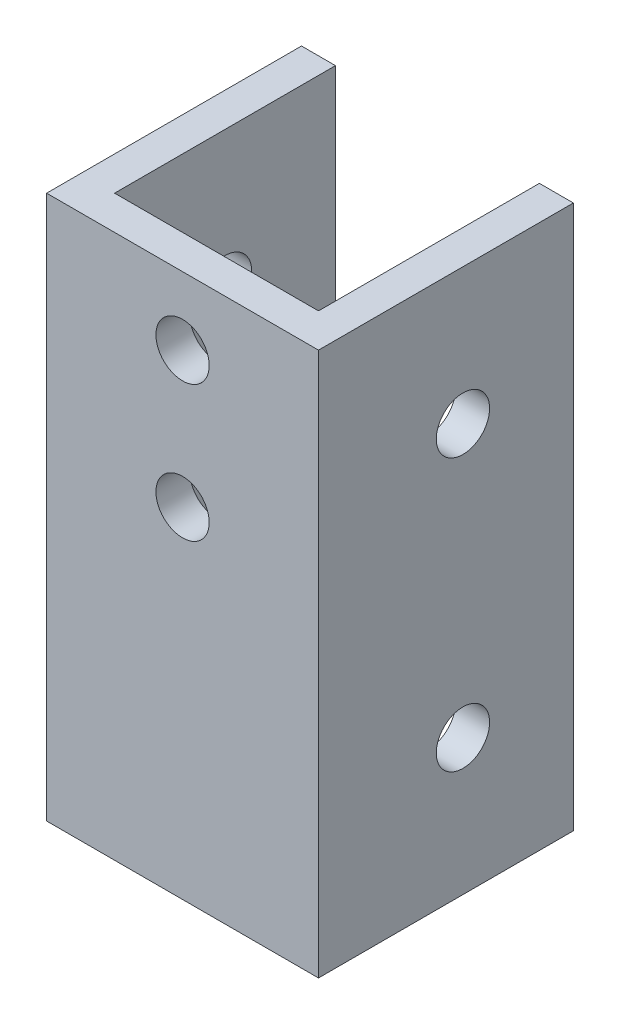
ISO-10303-21;
HEADER;
FILE_DESCRIPTION(('STEP AP214'),'2;1');
FILE_NAME('part.step','',(''),(''),'','','');
FILE_SCHEMA(('AUTOMOTIVE_DESIGN { 1 0 10303 214 1 1 1 1 }'));
ENDSEC;
DATA;
#1=APPLICATION_CONTEXT('core data for automotive mechanical design processes');
#2=APPLICATION_PROTOCOL_DEFINITION('international standard','automotive_design',2000,#1);
#3=PRODUCT_CONTEXT('',#1,'mechanical');
#4=PRODUCT('Part','Part','',(#3));
#5=PRODUCT_RELATED_PRODUCT_CATEGORY('part','',(#4));
#6=PRODUCT_DEFINITION_FORMATION('','',#4);
#7=PRODUCT_DEFINITION_CONTEXT('part definition',#1,'design');
#8=PRODUCT_DEFINITION('design','',#6,#7);
#9=PRODUCT_DEFINITION_SHAPE('','',#8);
#10=(LENGTH_UNIT() NAMED_UNIT(*) SI_UNIT(.MILLI.,.METRE.));
#11=(NAMED_UNIT(*) PLANE_ANGLE_UNIT() SI_UNIT($,.RADIAN.));
#12=(NAMED_UNIT(*) SI_UNIT($,.STERADIAN.) SOLID_ANGLE_UNIT());
#13=UNCERTAINTY_MEASURE_WITH_UNIT(LENGTH_MEASURE(1.E-05),#10,'distance_accuracy_value','');
#14=(GEOMETRIC_REPRESENTATION_CONTEXT(3) GLOBAL_UNCERTAINTY_ASSIGNED_CONTEXT((#13)) GLOBAL_UNIT_ASSIGNED_CONTEXT((#10,
#11,#12)) REPRESENTATION_CONTEXT('',''));
#15=CARTESIAN_POINT('',(0.,0.,0.));
#16=DIRECTION('',(0.,0.,1.));
#17=DIRECTION('',(1.,0.,0.));
#18=AXIS2_PLACEMENT_3D('',#15,#16,#17);
#19=CARTESIAN_POINT('',(0.,50.8,-23.8125));
#20=DIRECTION('',(1.,0.,0.));
#21=DIRECTION('',(0.,0.,-1.));
#22=AXIS2_PLACEMENT_3D('',#19,#20,#21);
#23=PLANE('',#22);
#24=CARTESIAN_POINT('',(0.,12.7,-13.49375));
#25=DIRECTION('',(1.,0.,0.));
#26=DIRECTION('',(0.,0.,-1.));
#27=AXIS2_PLACEMENT_3D('',#24,#25,#26);
#28=CIRCLE('',#27,2.4892);
#29=CARTESIAN_POINT('',(0.,12.7,-15.98295));
#30=VERTEX_POINT('',#29);
#31=EDGE_CURVE('E161',#30,#30,#28,.T.);
#32=ORIENTED_EDGE('',*,*,#31,.T.);
#33=EDGE_LOOP('',(#32));
#34=FACE_BOUND('',#33,.T.);
#35=CARTESIAN_POINT('',(0.,38.1,-13.49375));
#36=DIRECTION('',(1.,0.,0.));
#37=DIRECTION('',(0.,0.,-1.));
#38=AXIS2_PLACEMENT_3D('',#35,#36,#37);
#39=CIRCLE('',#38,2.4892);
#40=CARTESIAN_POINT('',(0.,38.1,-15.98295));
#41=VERTEX_POINT('',#40);
#42=EDGE_CURVE('E182',#41,#41,#39,.T.);
#43=ORIENTED_EDGE('',*,*,#42,.T.);
#44=EDGE_LOOP('',(#43));
#45=FACE_BOUND('',#44,.T.);
#46=DIRECTION('',(0.,0.,1.));
#47=VECTOR('',#46,1.);
#48=CARTESIAN_POINT('',(0.,0.,-23.8125));
#49=LINE('',#48,#47);
#50=CARTESIAN_POINT('',(0.,0.,-23.8125));
#51=VERTEX_POINT('',#50);
#52=CARTESIAN_POINT('',(0.,0.,0.));
#53=VERTEX_POINT('',#52);
#54=EDGE_CURVE('E130',#51,#53,#49,.T.);
#55=ORIENTED_EDGE('',*,*,#54,.T.);
#56=DIRECTION('',(0.,-1.,0.));
#57=VECTOR('',#56,1.);
#58=CARTESIAN_POINT('',(0.,50.8,0.));
#59=LINE('',#58,#57);
#60=CARTESIAN_POINT('',(0.,50.8,0.));
#61=VERTEX_POINT('',#60);
#62=EDGE_CURVE('E11',#61,#53,#59,.T.);
#63=ORIENTED_EDGE('',*,*,#62,.F.);
#64=DIRECTION('',(0.,0.,1.));
#65=VECTOR('',#64,1.);
#66=CARTESIAN_POINT('',(0.,50.8,-23.8125));
#67=LINE('',#66,#65);
#68=CARTESIAN_POINT('',(0.,50.8,-23.8125));
#69=VERTEX_POINT('',#68);
#70=EDGE_CURVE('E145',#69,#61,#67,.T.);
#71=ORIENTED_EDGE('',*,*,#70,.F.);
#72=DIRECTION('',(0.,-1.,0.));
#73=VECTOR('',#72,1.);
#74=CARTESIAN_POINT('',(0.,50.8,-23.8125));
#75=LINE('',#74,#73);
#76=EDGE_CURVE('E126',#69,#51,#75,.T.);
#77=ORIENTED_EDGE('',*,*,#76,.T.);
#78=EDGE_LOOP('',(#55,#63,#71,#77));
#79=FACE_BOUND('',#78,.T.);
#80=ADVANCED_FACE('F32',(#34,#45,#79),#23,.F.);
#81=CARTESIAN_POINT('',(0.,50.8,0.));
#82=DIRECTION('',(0.,0.,-1.));
#83=DIRECTION('',(-1.,0.,0.));
#84=AXIS2_PLACEMENT_3D('',#81,#82,#83);
#85=PLANE('',#84);
#86=CARTESIAN_POINT('',(12.7,44.45,0.));
#87=DIRECTION('',(0.,0.,1.));
#88=DIRECTION('',(1.,0.,0.));
#89=AXIS2_PLACEMENT_3D('',#86,#87,#88);
#90=CIRCLE('',#89,2.4892);
#91=CARTESIAN_POINT('',(15.1892,44.45,0.));
#92=VERTEX_POINT('',#91);
#93=EDGE_CURVE('E166',#92,#92,#90,.T.);
#94=ORIENTED_EDGE('',*,*,#93,.F.);
#95=EDGE_LOOP('',(#94));
#96=FACE_BOUND('',#95,.T.);
#97=CARTESIAN_POINT('',(12.7,31.75,0.));
#98=DIRECTION('',(0.,0.,1.));
#99=DIRECTION('',(1.,0.,0.));
#100=AXIS2_PLACEMENT_3D('',#97,#98,#99);
#101=CIRCLE('',#100,2.4892);
#102=CARTESIAN_POINT('',(15.1892,31.75,0.));
#103=VERTEX_POINT('',#102);
#104=EDGE_CURVE('E172',#103,#103,#101,.T.);
#105=ORIENTED_EDGE('',*,*,#104,.F.);
#106=EDGE_LOOP('',(#105));
#107=FACE_BOUND('',#106,.T.);
#108=DIRECTION('',(1.,0.,0.));
#109=VECTOR('',#108,1.);
#110=CARTESIAN_POINT('',(0.,0.,0.));
#111=LINE('',#110,#109);
#112=CARTESIAN_POINT('',(25.4,0.,0.));
#113=VERTEX_POINT('',#112);
#114=EDGE_CURVE('E133',#53,#113,#111,.T.);
#115=ORIENTED_EDGE('',*,*,#114,.T.);
#116=DIRECTION('',(0.,-1.,0.));
#117=VECTOR('',#116,1.);
#118=CARTESIAN_POINT('',(25.4,50.8,0.));
#119=LINE('',#118,#117);
#120=CARTESIAN_POINT('',(25.4,50.8,0.));
#121=VERTEX_POINT('',#120);
#122=EDGE_CURVE('E41',#121,#113,#119,.T.);
#123=ORIENTED_EDGE('',*,*,#122,.F.);
#124=DIRECTION('',(1.,0.,0.));
#125=VECTOR('',#124,1.);
#126=CARTESIAN_POINT('',(0.,50.8,0.));
#127=LINE('',#126,#125);
#128=EDGE_CURVE('E93',#61,#121,#127,.T.);
#129=ORIENTED_EDGE('',*,*,#128,.F.);
#130=ORIENTED_EDGE('',*,*,#62,.T.);
#131=EDGE_LOOP('',(#115,#123,#129,#130));
#132=FACE_BOUND('',#131,.T.);
#133=ADVANCED_FACE('F227',(#96,#107,#132),#85,.F.);
#134=CARTESIAN_POINT('',(25.4,50.8,0.));
#135=DIRECTION('',(-1.,0.,0.));
#136=DIRECTION('',(0.,0.,1.));
#137=AXIS2_PLACEMENT_3D('',#134,#135,#136);
#138=PLANE('',#137);
#139=CARTESIAN_POINT('',(25.4,12.7,-13.49375));
#140=DIRECTION('',(1.,0.,0.));
#141=DIRECTION('',(0.,0.,-1.));
#142=AXIS2_PLACEMENT_3D('',#139,#140,#141);
#143=CIRCLE('',#142,2.4892);
#144=CARTESIAN_POINT('',(25.4,12.7,-15.98295));
#145=VERTEX_POINT('',#144);
#146=EDGE_CURVE('E179',#145,#145,#143,.T.);
#147=ORIENTED_EDGE('',*,*,#146,.F.);
#148=EDGE_LOOP('',(#147));
#149=FACE_BOUND('',#148,.T.);
#150=CARTESIAN_POINT('',(25.4,38.1,-13.49375));
#151=DIRECTION('',(1.,0.,0.));
#152=DIRECTION('',(0.,0.,-1.));
#153=AXIS2_PLACEMENT_3D('',#150,#151,#152);
#154=CIRCLE('',#153,2.4892);
#155=CARTESIAN_POINT('',(25.4,38.1,-15.98295));
#156=VERTEX_POINT('',#155);
#157=EDGE_CURVE('E170',#156,#156,#154,.T.);
#158=ORIENTED_EDGE('',*,*,#157,.F.);
#159=EDGE_LOOP('',(#158));
#160=FACE_BOUND('',#159,.T.);
#161=DIRECTION('',(0.,0.,-1.));
#162=VECTOR('',#161,1.);
#163=CARTESIAN_POINT('',(25.4,0.,0.));
#164=LINE('',#163,#162);
#165=CARTESIAN_POINT('',(25.4,0.,-23.8125));
#166=VERTEX_POINT('',#165);
#167=EDGE_CURVE('E136',#113,#166,#164,.T.);
#168=ORIENTED_EDGE('',*,*,#167,.T.);
#169=DIRECTION('',(0.,-1.,0.));
#170=VECTOR('',#169,1.);
#171=CARTESIAN_POINT('',(25.4,50.8,-23.8125));
#172=LINE('',#171,#170);
#173=CARTESIAN_POINT('',(25.4,50.8,-23.8125));
#174=VERTEX_POINT('',#173);
#175=EDGE_CURVE('E152',#174,#166,#172,.T.);
#176=ORIENTED_EDGE('',*,*,#175,.F.);
#177=DIRECTION('',(0.,0.,-1.));
#178=VECTOR('',#177,1.);
#179=CARTESIAN_POINT('',(25.4,50.8,0.));
#180=LINE('',#179,#178);
#181=EDGE_CURVE('E195',#121,#174,#180,.T.);
#182=ORIENTED_EDGE('',*,*,#181,.F.);
#183=ORIENTED_EDGE('',*,*,#122,.T.);
#184=EDGE_LOOP('',(#168,#176,#182,#183));
#185=FACE_BOUND('',#184,.T.);
#186=ADVANCED_FACE('F232',(#149,#160,#185),#138,.F.);
#187=CARTESIAN_POINT('',(25.4,50.8,-23.8125));
#188=DIRECTION('',(0.,0.,1.));
#189=DIRECTION('',(1.,0.,0.));
#190=AXIS2_PLACEMENT_3D('',#187,#188,#189);
#191=PLANE('',#190);
#192=DIRECTION('',(-1.,0.,0.));
#193=VECTOR('',#192,1.);
#194=CARTESIAN_POINT('',(25.4,0.,-23.8125));
#195=LINE('',#194,#193);
#196=CARTESIAN_POINT('',(22.225,0.,-23.8125));
#197=VERTEX_POINT('',#196);
#198=EDGE_CURVE('E138',#166,#197,#195,.T.);
#199=ORIENTED_EDGE('',*,*,#198,.T.);
#200=DIRECTION('',(0.,-1.,0.));
#201=VECTOR('',#200,1.);
#202=CARTESIAN_POINT('',(22.225,50.8,-23.8125));
#203=LINE('',#202,#201);
#204=CARTESIAN_POINT('',(22.225,50.8,-23.8125));
#205=VERTEX_POINT('',#204);
#206=EDGE_CURVE('E149',#205,#197,#203,.T.);
#207=ORIENTED_EDGE('',*,*,#206,.F.);
#208=DIRECTION('',(-1.,0.,0.));
#209=VECTOR('',#208,1.);
#210=CARTESIAN_POINT('',(25.4,50.8,-23.8125));
#211=LINE('',#210,#209);
#212=EDGE_CURVE('E197',#174,#205,#211,.T.);
#213=ORIENTED_EDGE('',*,*,#212,.F.);
#214=ORIENTED_EDGE('',*,*,#175,.T.);
#215=EDGE_LOOP('',(#199,#207,#213,#214));
#216=FACE_BOUND('',#215,.T.);
#217=ADVANCED_FACE('F203',(#216),#191,.F.);
#218=CARTESIAN_POINT('',(22.225,50.8,-23.8125));
#219=DIRECTION('',(1.,0.,0.));
#220=DIRECTION('',(0.,0.,-1.));
#221=AXIS2_PLACEMENT_3D('',#218,#219,#220);
#222=PLANE('',#221);
#223=CARTESIAN_POINT('',(22.225,12.7,-13.49375));
#224=DIRECTION('',(1.,0.,0.));
#225=DIRECTION('',(0.,0.,-1.));
#226=AXIS2_PLACEMENT_3D('',#223,#224,#225);
#227=CIRCLE('',#226,2.4892);
#228=CARTESIAN_POINT('',(22.225,12.7,-15.98295));
#229=VERTEX_POINT('',#228);
#230=EDGE_CURVE('E134',#229,#229,#227,.T.);
#231=ORIENTED_EDGE('',*,*,#230,.T.);
#232=EDGE_LOOP('',(#231));
#233=FACE_BOUND('',#232,.T.);
#234=CARTESIAN_POINT('',(22.225,38.1,-13.49375));
#235=DIRECTION('',(1.,0.,0.));
#236=DIRECTION('',(0.,0.,-1.));
#237=AXIS2_PLACEMENT_3D('',#234,#235,#236);
#238=CIRCLE('',#237,2.4892);
#239=CARTESIAN_POINT('',(22.225,38.1,-15.98295));
#240=VERTEX_POINT('',#239);
#241=EDGE_CURVE('E160',#240,#240,#238,.T.);
#242=ORIENTED_EDGE('',*,*,#241,.T.);
#243=EDGE_LOOP('',(#242));
#244=FACE_BOUND('',#243,.T.);
#245=DIRECTION('',(0.,0.,1.));
#246=VECTOR('',#245,1.);
#247=CARTESIAN_POINT('',(22.225,0.,-23.8125));
#248=LINE('',#247,#246);
#249=CARTESIAN_POINT('',(22.225,0.,-3.175));
#250=VERTEX_POINT('',#249);
#251=EDGE_CURVE('E140',#197,#250,#248,.T.);
#252=ORIENTED_EDGE('',*,*,#251,.T.);
#253=DIRECTION('',(0.,-1.,0.));
#254=VECTOR('',#253,1.);
#255=CARTESIAN_POINT('',(22.225,50.8,-3.175));
#256=LINE('',#255,#254);
#257=CARTESIAN_POINT('',(22.225,50.8,-3.175));
#258=VERTEX_POINT('',#257);
#259=EDGE_CURVE('E121',#258,#250,#256,.T.);
#260=ORIENTED_EDGE('',*,*,#259,.F.);
#261=DIRECTION('',(0.,0.,1.));
#262=VECTOR('',#261,1.);
#263=CARTESIAN_POINT('',(22.225,50.8,-23.8125));
#264=LINE('',#263,#262);
#265=EDGE_CURVE('E112',#205,#258,#264,.T.);
#266=ORIENTED_EDGE('',*,*,#265,.F.);
#267=ORIENTED_EDGE('',*,*,#206,.T.);
#268=EDGE_LOOP('',(#252,#260,#266,#267));
#269=FACE_BOUND('',#268,.T.);
#270=ADVANCED_FACE('F207',(#233,#244,#269),#222,.F.);
#271=CARTESIAN_POINT('',(22.225,50.8,-3.175));
#272=DIRECTION('',(0.,0.,1.));
#273=DIRECTION('',(1.,0.,0.));
#274=AXIS2_PLACEMENT_3D('',#271,#272,#273);
#275=PLANE('',#274);
#276=CARTESIAN_POINT('',(12.7,44.45,-3.175));
#277=DIRECTION('',(0.,0.,1.));
#278=DIRECTION('',(1.,0.,0.));
#279=AXIS2_PLACEMENT_3D('',#276,#277,#278);
#280=CIRCLE('',#279,2.4892);
#281=CARTESIAN_POINT('',(15.1892,44.45,-3.175));
#282=VERTEX_POINT('',#281);
#283=EDGE_CURVE('E35',#282,#282,#280,.T.);
#284=ORIENTED_EDGE('',*,*,#283,.T.);
#285=EDGE_LOOP('',(#284));
#286=FACE_BOUND('',#285,.T.);
#287=CARTESIAN_POINT('',(12.7,31.75,-3.175));
#288=DIRECTION('',(0.,0.,1.));
#289=DIRECTION('',(1.,0.,0.));
#290=AXIS2_PLACEMENT_3D('',#287,#288,#289);
#291=CIRCLE('',#290,2.4892);
#292=CARTESIAN_POINT('',(15.1892,31.75,-3.175));
#293=VERTEX_POINT('',#292);
#294=EDGE_CURVE('E164',#293,#293,#291,.T.);
#295=ORIENTED_EDGE('',*,*,#294,.T.);
#296=EDGE_LOOP('',(#295));
#297=FACE_BOUND('',#296,.T.);
#298=DIRECTION('',(-1.,0.,0.));
#299=VECTOR('',#298,1.);
#300=CARTESIAN_POINT('',(22.225,0.,-3.175));
#301=LINE('',#300,#299);
#302=CARTESIAN_POINT('',(3.175,0.,-3.175));
#303=VERTEX_POINT('',#302);
#304=EDGE_CURVE('E120',#250,#303,#301,.T.);
#305=ORIENTED_EDGE('',*,*,#304,.T.);
#306=DIRECTION('',(0.,-1.,0.));
#307=VECTOR('',#306,1.);
#308=CARTESIAN_POINT('',(3.175,50.8,-3.175));
#309=LINE('',#308,#307);
#310=CARTESIAN_POINT('',(3.175,50.8,-3.175));
#311=VERTEX_POINT('',#310);
#312=EDGE_CURVE('E117',#311,#303,#309,.T.);
#313=ORIENTED_EDGE('',*,*,#312,.F.);
#314=DIRECTION('',(-1.,0.,0.));
#315=VECTOR('',#314,1.);
#316=CARTESIAN_POINT('',(22.225,50.8,-3.175));
#317=LINE('',#316,#315);
#318=EDGE_CURVE('E106',#258,#311,#317,.T.);
#319=ORIENTED_EDGE('',*,*,#318,.F.);
#320=ORIENTED_EDGE('',*,*,#259,.T.);
#321=EDGE_LOOP('',(#305,#313,#319,#320));
#322=FACE_BOUND('',#321,.T.);
#323=ADVANCED_FACE('F118',(#286,#297,#322),#275,.F.);
#324=CARTESIAN_POINT('',(3.175,50.8,-3.175));
#325=DIRECTION('',(-1.,0.,0.));
#326=DIRECTION('',(0.,0.,1.));
#327=AXIS2_PLACEMENT_3D('',#324,#325,#326);
#328=PLANE('',#327);
#329=CARTESIAN_POINT('',(3.175,12.7,-13.49375));
#330=DIRECTION('',(-1.,0.,0.));
#331=DIRECTION('',(0.,0.,1.));
#332=AXIS2_PLACEMENT_3D('',#329,#330,#331);
#333=CIRCLE('',#332,2.4892);
#334=CARTESIAN_POINT('',(3.175,12.7,-11.00455));
#335=VERTEX_POINT('',#334);
#336=EDGE_CURVE('E162',#335,#335,#333,.T.);
#337=ORIENTED_EDGE('',*,*,#336,.T.);
#338=EDGE_LOOP('',(#337));
#339=FACE_BOUND('',#338,.T.);
#340=CARTESIAN_POINT('',(3.175,38.1,-13.49375));
#341=DIRECTION('',(-1.,0.,0.));
#342=DIRECTION('',(0.,0.,1.));
#343=AXIS2_PLACEMENT_3D('',#340,#341,#342);
#344=CIRCLE('',#343,2.4892);
#345=CARTESIAN_POINT('',(3.175,38.1,-11.00455));
#346=VERTEX_POINT('',#345);
#347=EDGE_CURVE('E157',#346,#346,#344,.T.);
#348=ORIENTED_EDGE('',*,*,#347,.T.);
#349=EDGE_LOOP('',(#348));
#350=FACE_BOUND('',#349,.T.);
#351=DIRECTION('',(0.,0.,-1.));
#352=VECTOR('',#351,1.);
#353=CARTESIAN_POINT('',(3.175,0.,-3.175));
#354=LINE('',#353,#352);
#355=CARTESIAN_POINT('',(3.175,0.,-23.8125));
#356=VERTEX_POINT('',#355);
#357=EDGE_CURVE('E79',#303,#356,#354,.T.);
#358=ORIENTED_EDGE('',*,*,#357,.T.);
#359=DIRECTION('',(0.,-1.,0.));
#360=VECTOR('',#359,1.);
#361=CARTESIAN_POINT('',(3.175,50.8,-23.8125));
#362=LINE('',#361,#360);
#363=CARTESIAN_POINT('',(3.175,50.8,-23.8125));
#364=VERTEX_POINT('',#363);
#365=EDGE_CURVE('E122',#364,#356,#362,.T.);
#366=ORIENTED_EDGE('',*,*,#365,.F.);
#367=DIRECTION('',(0.,0.,-1.));
#368=VECTOR('',#367,1.);
#369=CARTESIAN_POINT('',(3.175,50.8,-3.175));
#370=LINE('',#369,#368);
#371=EDGE_CURVE('E110',#311,#364,#370,.T.);
#372=ORIENTED_EDGE('',*,*,#371,.F.);
#373=ORIENTED_EDGE('',*,*,#312,.T.);
#374=EDGE_LOOP('',(#358,#366,#372,#373));
#375=FACE_BOUND('',#374,.T.);
#376=ADVANCED_FACE('F124',(#339,#350,#375),#328,.F.);
#377=CARTESIAN_POINT('',(3.175,50.8,-23.8125));
#378=DIRECTION('',(0.,0.,1.));
#379=DIRECTION('',(1.,0.,0.));
#380=AXIS2_PLACEMENT_3D('',#377,#378,#379);
#381=PLANE('',#380);
#382=DIRECTION('',(-1.,0.,0.));
#383=VECTOR('',#382,1.);
#384=CARTESIAN_POINT('',(3.175,0.,-23.8125));
#385=LINE('',#384,#383);
#386=EDGE_CURVE('E85',#356,#51,#385,.T.);
#387=ORIENTED_EDGE('',*,*,#386,.T.);
#388=ORIENTED_EDGE('',*,*,#76,.F.);
#389=DIRECTION('',(-1.,0.,0.));
#390=VECTOR('',#389,1.);
#391=CARTESIAN_POINT('',(3.175,50.8,-23.8125));
#392=LINE('',#391,#390);
#393=EDGE_CURVE('E50',#364,#69,#392,.T.);
#394=ORIENTED_EDGE('',*,*,#393,.F.);
#395=ORIENTED_EDGE('',*,*,#365,.T.);
#396=EDGE_LOOP('',(#387,#388,#394,#395));
#397=FACE_BOUND('',#396,.T.);
#398=ADVANCED_FACE('F215',(#397),#381,.F.);
#399=CARTESIAN_POINT('',(0.,50.8,0.));
#400=DIRECTION('',(0.,1.,0.));
#401=DIRECTION('',(0.,0.,1.));
#402=AXIS2_PLACEMENT_3D('',#399,#400,#401);
#403=PLANE('',#402);
#404=ORIENTED_EDGE('',*,*,#70,.T.);
#405=ORIENTED_EDGE('',*,*,#128,.T.);
#406=ORIENTED_EDGE('',*,*,#181,.T.);
#407=ORIENTED_EDGE('',*,*,#212,.T.);
#408=ORIENTED_EDGE('',*,*,#265,.T.);
#409=ORIENTED_EDGE('',*,*,#318,.T.);
#410=ORIENTED_EDGE('',*,*,#371,.T.);
#411=ORIENTED_EDGE('',*,*,#393,.T.);
#412=EDGE_LOOP('',(#404,#405,#406,#407,#408,#409,#410,#411));
#413=FACE_BOUND('',#412,.T.);
#414=ADVANCED_FACE('F108',(#413),#403,.T.);
#415=CARTESIAN_POINT('',(0.,0.,0.));
#416=DIRECTION('',(0.,1.,0.));
#417=DIRECTION('',(0.,0.,1.));
#418=AXIS2_PLACEMENT_3D('',#415,#416,#417);
#419=PLANE('',#418);
#420=ORIENTED_EDGE('',*,*,#54,.F.);
#421=ORIENTED_EDGE('',*,*,#386,.F.);
#422=ORIENTED_EDGE('',*,*,#357,.F.);
#423=ORIENTED_EDGE('',*,*,#304,.F.);
#424=ORIENTED_EDGE('',*,*,#251,.F.);
#425=ORIENTED_EDGE('',*,*,#198,.F.);
#426=ORIENTED_EDGE('',*,*,#167,.F.);
#427=ORIENTED_EDGE('',*,*,#114,.F.);
#428=EDGE_LOOP('',(#420,#421,#422,#423,#424,#425,#426,#427));
#429=FACE_BOUND('',#428,.T.);
#430=ADVANCED_FACE('F210',(#429),#419,.F.);
#431=CARTESIAN_POINT('',(0.,38.1,-13.49375));
#432=DIRECTION('',(1.,0.,0.));
#433=DIRECTION('',(0.,0.,-1.));
#434=AXIS2_PLACEMENT_3D('',#431,#432,#433);
#435=CYLINDRICAL_SURFACE('',#434,2.4892);
#436=ORIENTED_EDGE('',*,*,#42,.F.);
#437=EDGE_LOOP('',(#436));
#438=FACE_BOUND('',#437,.T.);
#439=ORIENTED_EDGE('',*,*,#347,.F.);
#440=EDGE_LOOP('',(#439));
#441=FACE_BOUND('',#440,.T.);
#442=ADVANCED_FACE('F238',(#438,#441),#435,.F.);
#443=CARTESIAN_POINT('',(0.,12.7,-13.49375));
#444=DIRECTION('',(1.,0.,0.));
#445=DIRECTION('',(0.,0.,-1.));
#446=AXIS2_PLACEMENT_3D('',#443,#444,#445);
#447=CYLINDRICAL_SURFACE('',#446,2.4892);
#448=ORIENTED_EDGE('',*,*,#31,.F.);
#449=EDGE_LOOP('',(#448));
#450=FACE_BOUND('',#449,.T.);
#451=ORIENTED_EDGE('',*,*,#336,.F.);
#452=EDGE_LOOP('',(#451));
#453=FACE_BOUND('',#452,.T.);
#454=ADVANCED_FACE('F241',(#450,#453),#447,.F.);
#455=ORIENTED_EDGE('',*,*,#157,.T.);
#456=EDGE_LOOP('',(#455));
#457=FACE_BOUND('',#456,.T.);
#458=ORIENTED_EDGE('',*,*,#241,.F.);
#459=EDGE_LOOP('',(#458));
#460=FACE_BOUND('',#459,.T.);
#461=ADVANCED_FACE('F243',(#457,#460),#435,.F.);
#462=ORIENTED_EDGE('',*,*,#146,.T.);
#463=EDGE_LOOP('',(#462));
#464=FACE_BOUND('',#463,.T.);
#465=ORIENTED_EDGE('',*,*,#230,.F.);
#466=EDGE_LOOP('',(#465));
#467=FACE_BOUND('',#466,.T.);
#468=ADVANCED_FACE('F252',(#464,#467),#447,.F.);
#469=CARTESIAN_POINT('',(12.7,31.75,-23.8125));
#470=DIRECTION('',(0.,0.,1.));
#471=DIRECTION('',(1.,0.,0.));
#472=AXIS2_PLACEMENT_3D('',#469,#470,#471);
#473=CYLINDRICAL_SURFACE('',#472,2.4892);
#474=ORIENTED_EDGE('',*,*,#104,.T.);
#475=EDGE_LOOP('',(#474));
#476=FACE_BOUND('',#475,.T.);
#477=ORIENTED_EDGE('',*,*,#294,.F.);
#478=EDGE_LOOP('',(#477));
#479=FACE_BOUND('',#478,.T.);
#480=ADVANCED_FACE('F258',(#476,#479),#473,.F.);
#481=CARTESIAN_POINT('',(12.7,44.45,-23.8125));
#482=DIRECTION('',(0.,0.,1.));
#483=DIRECTION('',(1.,0.,0.));
#484=AXIS2_PLACEMENT_3D('',#481,#482,#483);
#485=CYLINDRICAL_SURFACE('',#484,2.4892);
#486=ORIENTED_EDGE('',*,*,#93,.T.);
#487=EDGE_LOOP('',(#486));
#488=FACE_BOUND('',#487,.T.);
#489=ORIENTED_EDGE('',*,*,#283,.F.);
#490=EDGE_LOOP('',(#489));
#491=FACE_BOUND('',#490,.T.);
#492=ADVANCED_FACE('F337',(#488,#491),#485,.F.);
#493=CLOSED_SHELL('',(#80,#133,#186,#217,#270,#323,#376,#398,#414,#430,#442,#454,#461,#468,#480,#492));
#494=MANIFOLD_SOLID_BREP('B2',#493);
#495=ADVANCED_BREP_SHAPE_REPRESENTATION('',(#18,#494),#14);
#496=SHAPE_DEFINITION_REPRESENTATION(#9,#495);
ENDSEC;
END-ISO-10303-21;
